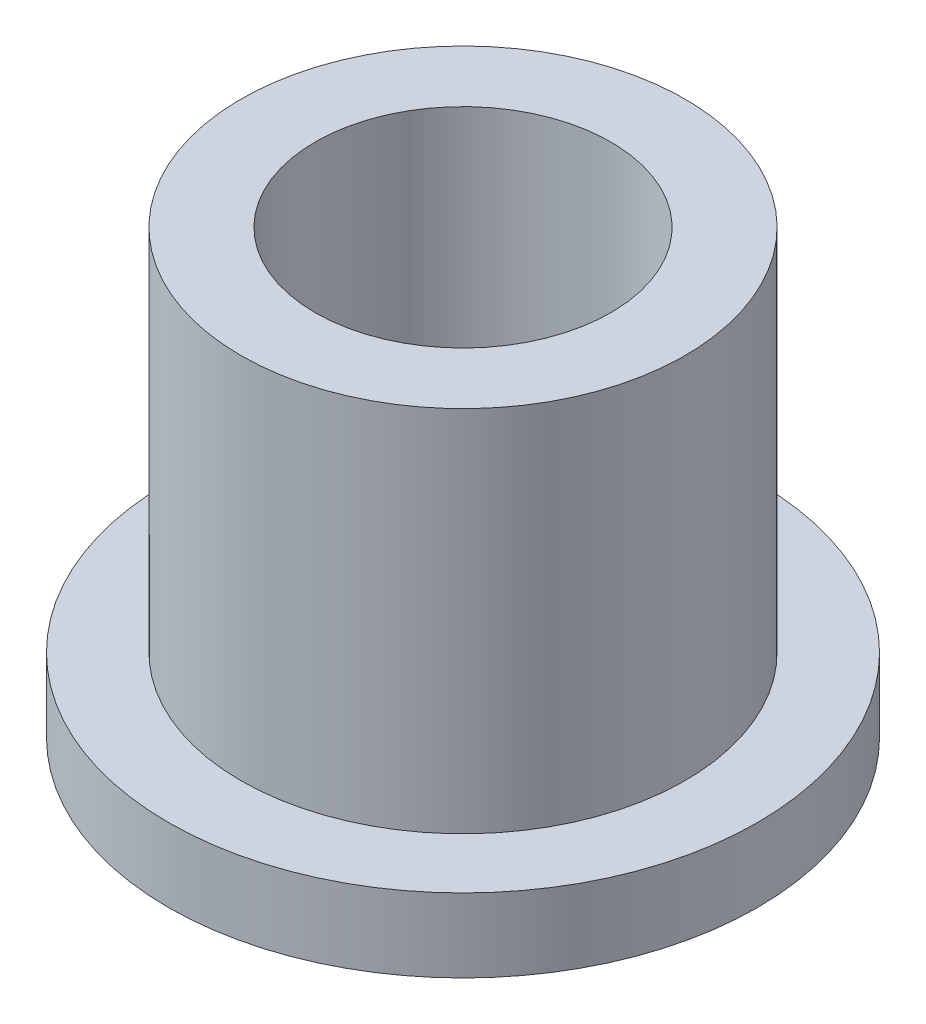
ISO-10303-21;
HEADER;
FILE_DESCRIPTION(('STEP AP214'),'2;1');
FILE_NAME('part.step','',(''),(''),'','','');
FILE_SCHEMA(('AUTOMOTIVE_DESIGN { 1 0 10303 214 1 1 1 1 }'));
ENDSEC;
DATA;
#1=APPLICATION_CONTEXT('core data for automotive mechanical design processes');
#2=APPLICATION_PROTOCOL_DEFINITION('international standard','automotive_design',2000,#1);
#3=PRODUCT_CONTEXT('',#1,'mechanical');
#4=PRODUCT('Part','Part','',(#3));
#5=PRODUCT_RELATED_PRODUCT_CATEGORY('part','',(#4));
#6=PRODUCT_DEFINITION_FORMATION('','',#4);
#7=PRODUCT_DEFINITION_CONTEXT('part definition',#1,'design');
#8=PRODUCT_DEFINITION('design','',#6,#7);
#9=PRODUCT_DEFINITION_SHAPE('','',#8);
#10=(LENGTH_UNIT() NAMED_UNIT(*) SI_UNIT(.MILLI.,.METRE.));
#11=(NAMED_UNIT(*) PLANE_ANGLE_UNIT() SI_UNIT($,.RADIAN.));
#12=(NAMED_UNIT(*) SI_UNIT($,.STERADIAN.) SOLID_ANGLE_UNIT());
#13=UNCERTAINTY_MEASURE_WITH_UNIT(LENGTH_MEASURE(1.E-05),#10,'distance_accuracy_value','');
#14=(GEOMETRIC_REPRESENTATION_CONTEXT(3) GLOBAL_UNCERTAINTY_ASSIGNED_CONTEXT((#13)) GLOBAL_UNIT_ASSIGNED_CONTEXT((#10,
#11,#12)) REPRESENTATION_CONTEXT('',''));
#15=CARTESIAN_POINT('',(0.,0.,0.));
#16=DIRECTION('',(0.,0.,1.));
#17=DIRECTION('',(1.,0.,0.));
#18=AXIS2_PLACEMENT_3D('',#15,#16,#17);
#19=CARTESIAN_POINT('',(0.,9.525,0.));
#20=DIRECTION('',(0.,1.,0.));
#21=DIRECTION('',(0.,0.,1.));
#22=AXIS2_PLACEMENT_3D('',#19,#20,#21);
#23=PLANE('',#22);
#24=CARTESIAN_POINT('',(0.,9.525,0.));
#25=DIRECTION('',(0.,1.,0.));
#26=DIRECTION('',(0.,0.,1.));
#27=AXIS2_PLACEMENT_3D('',#24,#25,#26);
#28=CIRCLE('',#27,4.7879);
#29=CARTESIAN_POINT('',(0.,9.525,4.7879));
#30=VERTEX_POINT('',#29);
#31=EDGE_CURVE('E10',#30,#30,#28,.T.);
#32=ORIENTED_EDGE('',*,*,#31,.T.);
#33=EDGE_LOOP('',(#32));
#34=FACE_BOUND('',#33,.T.);
#35=CARTESIAN_POINT('',(0.,9.525,0.));
#36=DIRECTION('',(0.,1.,0.));
#37=DIRECTION('',(0.,0.,1.));
#38=AXIS2_PLACEMENT_3D('',#35,#36,#37);
#39=CIRCLE('',#38,3.1877);
#40=CARTESIAN_POINT('',(0.,9.525,3.1877));
#41=VERTEX_POINT('',#40);
#42=EDGE_CURVE('E44',#41,#41,#39,.T.);
#43=ORIENTED_EDGE('',*,*,#42,.F.);
#44=EDGE_LOOP('',(#43));
#45=FACE_BOUND('',#44,.T.);
#46=ADVANCED_FACE('F36',(#34,#45),#23,.T.);
#47=CARTESIAN_POINT('',(0.,0.,0.));
#48=DIRECTION('',(0.,1.,0.));
#49=DIRECTION('',(0.,0.,1.));
#50=AXIS2_PLACEMENT_3D('',#47,#48,#49);
#51=PLANE('',#50);
#52=CARTESIAN_POINT('',(0.,0.,0.));
#53=DIRECTION('',(0.,1.,0.));
#54=DIRECTION('',(0.,0.,1.));
#55=AXIS2_PLACEMENT_3D('',#52,#53,#54);
#56=CIRCLE('',#55,3.1877);
#57=CARTESIAN_POINT('',(0.,0.,3.1877));
#58=VERTEX_POINT('',#57);
#59=EDGE_CURVE('E50',#58,#58,#56,.T.);
#60=ORIENTED_EDGE('',*,*,#59,.T.);
#61=EDGE_LOOP('',(#60));
#62=FACE_BOUND('',#61,.T.);
#63=CARTESIAN_POINT('',(0.,0.,0.));
#64=DIRECTION('',(0.,1.,0.));
#65=DIRECTION('',(0.,0.,1.));
#66=AXIS2_PLACEMENT_3D('',#63,#64,#65);
#67=CIRCLE('',#66,6.35);
#68=CARTESIAN_POINT('',(0.,0.,6.35));
#69=VERTEX_POINT('',#68);
#70=EDGE_CURVE('E59',#69,#69,#67,.T.);
#71=ORIENTED_EDGE('',*,*,#70,.F.);
#72=EDGE_LOOP('',(#71));
#73=FACE_BOUND('',#72,.T.);
#74=ADVANCED_FACE('F88',(#62,#73),#51,.F.);
#75=CARTESIAN_POINT('',(0.,9.525,0.));
#76=DIRECTION('',(0.,-1.,0.));
#77=DIRECTION('',(0.,0.,-1.));
#78=AXIS2_PLACEMENT_3D('',#75,#76,#77);
#79=CYLINDRICAL_SURFACE('',#78,4.7879);
#80=CARTESIAN_POINT('',(0.,1.5875,0.));
#81=DIRECTION('',(0.,1.,0.));
#82=DIRECTION('',(0.,0.,1.));
#83=AXIS2_PLACEMENT_3D('',#80,#81,#82);
#84=CIRCLE('',#83,4.7879);
#85=CARTESIAN_POINT('',(0.,1.5875,4.7879));
#86=VERTEX_POINT('',#85);
#87=EDGE_CURVE('E63',#86,#86,#84,.T.);
#88=ORIENTED_EDGE('',*,*,#87,.T.);
#89=EDGE_LOOP('',(#88));
#90=FACE_BOUND('',#89,.T.);
#91=ORIENTED_EDGE('',*,*,#31,.F.);
#92=EDGE_LOOP('',(#91));
#93=FACE_BOUND('',#92,.T.);
#94=ADVANCED_FACE('F38',(#90,#93),#79,.T.);
#95=CARTESIAN_POINT('',(0.,9.525,0.));
#96=DIRECTION('',(0.,-1.,0.));
#97=DIRECTION('',(0.,0.,-1.));
#98=AXIS2_PLACEMENT_3D('',#95,#96,#97);
#99=CYLINDRICAL_SURFACE('',#98,3.1877);
#100=ORIENTED_EDGE('',*,*,#42,.T.);
#101=EDGE_LOOP('',(#100));
#102=FACE_BOUND('',#101,.T.);
#103=ORIENTED_EDGE('',*,*,#59,.F.);
#104=EDGE_LOOP('',(#103));
#105=FACE_BOUND('',#104,.T.);
#106=ADVANCED_FACE('F77',(#102,#105),#99,.F.);
#107=CARTESIAN_POINT('',(0.,1.5875,0.));
#108=DIRECTION('',(0.,1.,0.));
#109=DIRECTION('',(0.,0.,1.));
#110=AXIS2_PLACEMENT_3D('',#107,#108,#109);
#111=PLANE('',#110);
#112=CARTESIAN_POINT('',(0.,1.5875,0.));
#113=DIRECTION('',(0.,1.,0.));
#114=DIRECTION('',(0.,0.,1.));
#115=AXIS2_PLACEMENT_3D('',#112,#113,#114);
#116=CIRCLE('',#115,6.35);
#117=CARTESIAN_POINT('',(0.,1.5875,6.35));
#118=VERTEX_POINT('',#117);
#119=EDGE_CURVE('E57',#118,#118,#116,.T.);
#120=ORIENTED_EDGE('',*,*,#119,.T.);
#121=EDGE_LOOP('',(#120));
#122=FACE_BOUND('',#121,.T.);
#123=ORIENTED_EDGE('',*,*,#87,.F.);
#124=EDGE_LOOP('',(#123));
#125=FACE_BOUND('',#124,.T.);
#126=ADVANCED_FACE('F74',(#122,#125),#111,.T.);
#127=CARTESIAN_POINT('',(0.,1.5875,0.));
#128=DIRECTION('',(0.,-1.,0.));
#129=DIRECTION('',(0.,0.,-1.));
#130=AXIS2_PLACEMENT_3D('',#127,#128,#129);
#131=CYLINDRICAL_SURFACE('',#130,6.35);
#132=ORIENTED_EDGE('',*,*,#119,.F.);
#133=EDGE_LOOP('',(#132));
#134=FACE_BOUND('',#133,.T.);
#135=ORIENTED_EDGE('',*,*,#70,.T.);
#136=EDGE_LOOP('',(#135));
#137=FACE_BOUND('',#136,.T.);
#138=ADVANCED_FACE('F76',(#134,#137),#131,.T.);
#139=CLOSED_SHELL('',(#46,#74,#94,#106,#126,#138));
#140=MANIFOLD_SOLID_BREP('B2',#139);
#141=ADVANCED_BREP_SHAPE_REPRESENTATION('',(#18,#140),#14);
#142=SHAPE_DEFINITION_REPRESENTATION(#9,#141);
ENDSEC;
END-ISO-10303-21;
